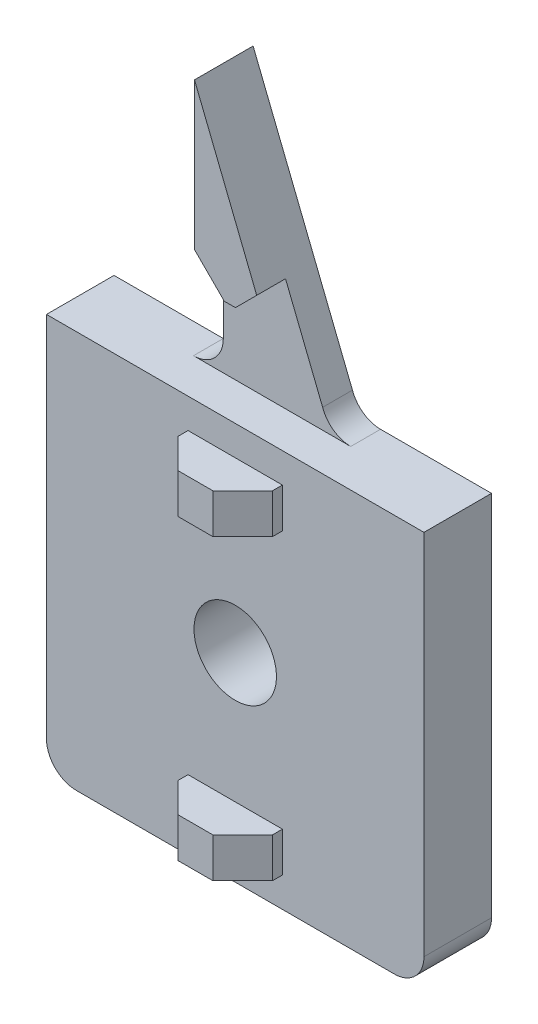
ISO-10303-21;
HEADER;
FILE_DESCRIPTION(('STEP AP214'),'2;1');
FILE_NAME('part.step','',(''),(''),'','','');
FILE_SCHEMA(('AUTOMOTIVE_DESIGN { 1 0 10303 214 1 1 1 1 }'));
ENDSEC;
DATA;
#1=APPLICATION_CONTEXT('core data for automotive mechanical design processes');
#2=APPLICATION_PROTOCOL_DEFINITION('international standard','automotive_design',2000,#1);
#3=PRODUCT_CONTEXT('',#1,'mechanical');
#4=PRODUCT('Part','Part','',(#3));
#5=PRODUCT_RELATED_PRODUCT_CATEGORY('part','',(#4));
#6=PRODUCT_DEFINITION_FORMATION('','',#4);
#7=PRODUCT_DEFINITION_CONTEXT('part definition',#1,'design');
#8=PRODUCT_DEFINITION('design','',#6,#7);
#9=PRODUCT_DEFINITION_SHAPE('','',#8);
#10=(LENGTH_UNIT() NAMED_UNIT(*) SI_UNIT(.MILLI.,.METRE.));
#11=(NAMED_UNIT(*) PLANE_ANGLE_UNIT() SI_UNIT($,.RADIAN.));
#12=(NAMED_UNIT(*) SI_UNIT($,.STERADIAN.) SOLID_ANGLE_UNIT());
#13=UNCERTAINTY_MEASURE_WITH_UNIT(LENGTH_MEASURE(1.E-05),#10,'distance_accuracy_value','');
#14=(GEOMETRIC_REPRESENTATION_CONTEXT(3) GLOBAL_UNCERTAINTY_ASSIGNED_CONTEXT((#13)) GLOBAL_UNIT_ASSIGNED_CONTEXT((#10,
#11,#12)) REPRESENTATION_CONTEXT('',''));
#15=CARTESIAN_POINT('',(0.,0.,0.));
#16=DIRECTION('',(0.,0.,1.));
#17=DIRECTION('',(1.,0.,0.));
#18=AXIS2_PLACEMENT_3D('',#15,#16,#17);
#19=CARTESIAN_POINT('',(0.,0.,0.));
#20=DIRECTION('',(0.,0.,1.));
#21=DIRECTION('',(1.,0.,0.));
#22=AXIS2_PLACEMENT_3D('',#19,#20,#21);
#23=PLANE('',#22);
#24=DIRECTION('',(-0.371390676354104,0.928476690885259,0.));
#25=VECTOR('',#24,1.);
#26=CARTESIAN_POINT('',(11.8965517241379,4.75862068965518,0.));
#27=LINE('',#26,#25);
#28=CARTESIAN_POINT('',(5.,22.,0.));
#29=VERTEX_POINT('',#28);
#30=CARTESIAN_POINT('',(1.26285714285709,31.3428571428573,0.));
#31=VERTEX_POINT('',#30);
#32=EDGE_CURVE('E303',#29,#31,#27,.T.);
#33=ORIENTED_EDGE('',*,*,#32,.T.);
#34=DIRECTION('',(-0.70710678118655,-0.707106781186545,0.));
#35=VECTOR('',#34,1.);
#36=CARTESIAN_POINT('',(1.2628571428571,31.3428571428573,0.));
#37=LINE('',#36,#35);
#38=CARTESIAN_POINT('',(-0.88000000000007,29.2000000000001,0.));
#39=VERTEX_POINT('',#38);
#40=EDGE_CURVE('E11',#31,#39,#37,.T.);
#41=ORIENTED_EDGE('',*,*,#40,.T.);
#42=DIRECTION('',(1.,0.,0.));
#43=VECTOR('',#42,1.);
#44=CARTESIAN_POINT('',(-5.,29.2000000000001,0.));
#45=LINE('',#44,#43);
#46=CARTESIAN_POINT('',(-2.,29.2000000000001,0.));
#47=VERTEX_POINT('',#46);
#48=EDGE_CURVE('E246',#47,#39,#45,.T.);
#49=ORIENTED_EDGE('',*,*,#48,.F.);
#50=DIRECTION('',(-0.707106781186546,0.707106781186549,0.));
#51=VECTOR('',#50,1.);
#52=CARTESIAN_POINT('',(-2.,29.2000000000001,0.));
#53=LINE('',#52,#51);
#54=CARTESIAN_POINT('',(-5.,32.2000000000001,0.));
#55=VERTEX_POINT('',#54);
#56=EDGE_CURVE('E47',#47,#55,#53,.T.);
#57=ORIENTED_EDGE('',*,*,#56,.T.);
#58=DIRECTION('',(0.,-1.,0.));
#59=VECTOR('',#58,1.);
#60=CARTESIAN_POINT('',(-5.,0.,0.));
#61=LINE('',#60,#59);
#62=CARTESIAN_POINT('',(-5.,23.,0.));
#63=VERTEX_POINT('',#62);
#64=EDGE_CURVE('E304',#55,#63,#61,.T.);
#65=ORIENTED_EDGE('',*,*,#64,.T.);
#66=CARTESIAN_POINT('',(-8.,23.,0.));
#67=DIRECTION('',(0.,0.,1.));
#68=DIRECTION('',(1.,0.,0.));
#69=AXIS2_PLACEMENT_3D('',#66,#67,#68);
#70=CIRCLE('',#69,3.);
#71=CARTESIAN_POINT('',(-8.,20.,0.));
#72=VERTEX_POINT('',#71);
#73=EDGE_CURVE('E374',#63,#72,#70,.F.);
#74=ORIENTED_EDGE('',*,*,#73,.T.);
#75=DIRECTION('',(-1.,0.,0.));
#76=VECTOR('',#75,1.);
#77=CARTESIAN_POINT('',(0.,20.,0.));
#78=LINE('',#77,#76);
#79=CARTESIAN_POINT('',(7.8284271247462,20.,0.));
#80=VERTEX_POINT('',#79);
#81=EDGE_CURVE('E308',#80,#72,#78,.T.);
#82=ORIENTED_EDGE('',*,*,#81,.F.);
#83=CARTESIAN_POINT('',(7.8284271247462,23.,0.));
#84=DIRECTION('',(0.,0.,1.));
#85=DIRECTION('',(1.,0.,0.));
#86=AXIS2_PLACEMENT_3D('',#83,#84,#85);
#87=CIRCLE('',#86,3.);
#88=EDGE_CURVE('E379',#80,#29,#87,.F.);
#89=ORIENTED_EDGE('',*,*,#88,.T.);
#90=EDGE_LOOP('',(#33,#41,#49,#57,#65,#74,#82,#89));
#91=FACE_BOUND('',#90,.T.);
#92=ADVANCED_FACE('F39',(#91),#23,.T.);
#93=CARTESIAN_POINT('',(0.,0.,3.8));
#94=DIRECTION('',(0.,0.,-1.));
#95=DIRECTION('',(-1.,0.,0.));
#96=AXIS2_PLACEMENT_3D('',#93,#94,#95);
#97=PLANE('',#96);
#98=DIRECTION('',(0.,1.,0.));
#99=VECTOR('',#98,1.);
#100=CARTESIAN_POINT('',(4.75,13.,3.8));
#101=LINE('',#100,#99);
#102=CARTESIAN_POINT('',(4.75,13.,3.8));
#103=VERTEX_POINT('',#102);
#104=CARTESIAN_POINT('',(4.75,17.,3.8));
#105=VERTEX_POINT('',#104);
#106=EDGE_CURVE('E277',#103,#105,#101,.T.);
#107=ORIENTED_EDGE('',*,*,#106,.F.);
#108=DIRECTION('',(1.,0.,0.));
#109=VECTOR('',#108,1.);
#110=CARTESIAN_POINT('',(-4.75,13.,3.8));
#111=LINE('',#110,#109);
#112=CARTESIAN_POINT('',(-4.75,13.,3.8));
#113=VERTEX_POINT('',#112);
#114=EDGE_CURVE('E282',#113,#103,#111,.T.);
#115=ORIENTED_EDGE('',*,*,#114,.F.);
#116=DIRECTION('',(0.,-1.,0.));
#117=VECTOR('',#116,1.);
#118=CARTESIAN_POINT('',(-4.75,13.,3.8));
#119=LINE('',#118,#117);
#120=CARTESIAN_POINT('',(-4.75,17.,3.8));
#121=VERTEX_POINT('',#120);
#122=EDGE_CURVE('E291',#121,#113,#119,.T.);
#123=ORIENTED_EDGE('',*,*,#122,.F.);
#124=DIRECTION('',(-1.,0.,0.));
#125=VECTOR('',#124,1.);
#126=CARTESIAN_POINT('',(-4.75,17.,3.8));
#127=LINE('',#126,#125);
#128=EDGE_CURVE('E288',#105,#121,#127,.T.);
#129=ORIENTED_EDGE('',*,*,#128,.F.);
#130=EDGE_LOOP('',(#107,#115,#123,#129));
#131=FACE_BOUND('',#130,.T.);
#132=DIRECTION('',(1.,0.,0.));
#133=VECTOR('',#132,1.);
#134=CARTESIAN_POINT('',(-19.,-20.,3.8));
#135=LINE('',#134,#133);
#136=CARTESIAN_POINT('',(-16.,-20.,3.8));
#137=VERTEX_POINT('',#136);
#138=CARTESIAN_POINT('',(16.,-20.,3.8));
#139=VERTEX_POINT('',#138);
#140=EDGE_CURVE('E339',#137,#139,#135,.T.);
#141=ORIENTED_EDGE('',*,*,#140,.T.);
#142=CARTESIAN_POINT('',(16.,-17.,3.8));
#143=DIRECTION('',(0.,0.,-1.));
#144=DIRECTION('',(-1.,0.,0.));
#145=AXIS2_PLACEMENT_3D('',#142,#143,#144);
#146=CIRCLE('',#145,3.);
#147=CARTESIAN_POINT('',(19.,-17.,3.8));
#148=VERTEX_POINT('',#147);
#149=EDGE_CURVE('E370',#139,#148,#146,.F.);
#150=ORIENTED_EDGE('',*,*,#149,.T.);
#151=DIRECTION('',(0.,1.,0.));
#152=VECTOR('',#151,1.);
#153=CARTESIAN_POINT('',(19.,-20.,3.8));
#154=LINE('',#153,#152);
#155=CARTESIAN_POINT('',(19.,20.,3.8));
#156=VERTEX_POINT('',#155);
#157=EDGE_CURVE('E332',#148,#156,#154,.T.);
#158=ORIENTED_EDGE('',*,*,#157,.T.);
#159=DIRECTION('',(-1.,0.,0.));
#160=VECTOR('',#159,1.);
#161=CARTESIAN_POINT('',(-19.,20.,3.8));
#162=LINE('',#161,#160);
#163=CARTESIAN_POINT('',(-19.,20.,3.8));
#164=VERTEX_POINT('',#163);
#165=EDGE_CURVE('E334',#156,#164,#162,.T.);
#166=ORIENTED_EDGE('',*,*,#165,.T.);
#167=DIRECTION('',(0.,-1.,0.));
#168=VECTOR('',#167,1.);
#169=CARTESIAN_POINT('',(-19.,-20.,3.8));
#170=LINE('',#169,#168);
#171=CARTESIAN_POINT('',(-19.,-17.,3.8));
#172=VERTEX_POINT('',#171);
#173=EDGE_CURVE('E336',#164,#172,#170,.T.);
#174=ORIENTED_EDGE('',*,*,#173,.T.);
#175=CARTESIAN_POINT('',(-16.,-17.,3.8));
#176=DIRECTION('',(0.,0.,-1.));
#177=DIRECTION('',(-1.,0.,0.));
#178=AXIS2_PLACEMENT_3D('',#175,#176,#177);
#179=CIRCLE('',#178,3.);
#180=EDGE_CURVE('E368',#172,#137,#179,.F.);
#181=ORIENTED_EDGE('',*,*,#180,.T.);
#182=EDGE_LOOP('',(#141,#150,#158,#166,#174,#181));
#183=FACE_BOUND('',#182,.T.);
#184=CARTESIAN_POINT('',(0.,0.,3.8));
#185=DIRECTION('',(0.,0.,1.));
#186=DIRECTION('',(1.,0.,0.));
#187=AXIS2_PLACEMENT_3D('',#184,#185,#186);
#188=CIRCLE('',#187,4.15);
#189=CARTESIAN_POINT('',(-4.15,0.,3.8));
#190=VERTEX_POINT('',#189);
#191=EDGE_CURVE('E329',#190,#190,#188,.T.);
#192=ORIENTED_EDGE('',*,*,#191,.F.);
#193=EDGE_LOOP('',(#192));
#194=FACE_BOUND('',#193,.T.);
#195=DIRECTION('',(0.,1.,0.));
#196=VECTOR('',#195,1.);
#197=CARTESIAN_POINT('',(4.75,-17.,3.8));
#198=LINE('',#197,#196);
#199=CARTESIAN_POINT('',(4.75,-17.,3.8));
#200=VERTEX_POINT('',#199);
#201=CARTESIAN_POINT('',(4.75,-13.,3.8));
#202=VERTEX_POINT('',#201);
#203=EDGE_CURVE('E230',#200,#202,#198,.T.);
#204=ORIENTED_EDGE('',*,*,#203,.F.);
#205=DIRECTION('',(1.,0.,0.));
#206=VECTOR('',#205,1.);
#207=CARTESIAN_POINT('',(-4.75,-17.,3.8));
#208=LINE('',#207,#206);
#209=CARTESIAN_POINT('',(-4.75,-17.,3.8));
#210=VERTEX_POINT('',#209);
#211=EDGE_CURVE('E256',#210,#200,#208,.T.);
#212=ORIENTED_EDGE('',*,*,#211,.F.);
#213=DIRECTION('',(0.,-1.,0.));
#214=VECTOR('',#213,1.);
#215=CARTESIAN_POINT('',(-4.75,-17.,3.8));
#216=LINE('',#215,#214);
#217=CARTESIAN_POINT('',(-4.75,-13.,3.8));
#218=VERTEX_POINT('',#217);
#219=EDGE_CURVE('E265',#218,#210,#216,.T.);
#220=ORIENTED_EDGE('',*,*,#219,.F.);
#221=DIRECTION('',(-1.,0.,0.));
#222=VECTOR('',#221,1.);
#223=CARTESIAN_POINT('',(-4.75,-13.,3.8));
#224=LINE('',#223,#222);
#225=EDGE_CURVE('E262',#202,#218,#224,.T.);
#226=ORIENTED_EDGE('',*,*,#225,.F.);
#227=EDGE_LOOP('',(#204,#212,#220,#226));
#228=FACE_BOUND('',#227,.T.);
#229=ADVANCED_FACE('F470',(#131,#183,#194,#228),#97,.F.);
#230=CARTESIAN_POINT('',(19.,-20.,3.8));
#231=DIRECTION('',(-1.,0.,0.));
#232=DIRECTION('',(0.,0.,1.));
#233=AXIS2_PLACEMENT_3D('',#230,#231,#232);
#234=PLANE('',#233);
#235=ORIENTED_EDGE('',*,*,#157,.F.);
#236=DIRECTION('',(0.,0.,-1.));
#237=VECTOR('',#236,1.);
#238=CARTESIAN_POINT('',(19.,-17.,3.8));
#239=LINE('',#238,#237);
#240=CARTESIAN_POINT('',(19.,-17.,-3.));
#241=VERTEX_POINT('',#240);
#242=EDGE_CURVE('E356',#148,#241,#239,.T.);
#243=ORIENTED_EDGE('',*,*,#242,.T.);
#244=DIRECTION('',(0.,1.,0.));
#245=VECTOR('',#244,1.);
#246=CARTESIAN_POINT('',(19.,-20.,-3.));
#247=LINE('',#246,#245);
#248=CARTESIAN_POINT('',(19.,20.,-3.));
#249=VERTEX_POINT('',#248);
#250=EDGE_CURVE('E317',#241,#249,#247,.T.);
#251=ORIENTED_EDGE('',*,*,#250,.T.);
#252=DIRECTION('',(0.,0.,-1.));
#253=VECTOR('',#252,1.);
#254=CARTESIAN_POINT('',(19.,20.,3.8));
#255=LINE('',#254,#253);
#256=EDGE_CURVE('E345',#156,#249,#255,.T.);
#257=ORIENTED_EDGE('',*,*,#256,.F.);
#258=EDGE_LOOP('',(#235,#243,#251,#257));
#259=FACE_BOUND('',#258,.T.);
#260=ADVANCED_FACE('F458',(#259),#234,.F.);
#261=CARTESIAN_POINT('',(-19.,20.,3.8));
#262=DIRECTION('',(0.,-1.,0.));
#263=DIRECTION('',(0.,0.,-1.));
#264=AXIS2_PLACEMENT_3D('',#261,#262,#263);
#265=PLANE('',#264);
#266=ORIENTED_EDGE('',*,*,#81,.T.);
#267=DIRECTION('',(0.,0.,1.));
#268=VECTOR('',#267,1.);
#269=CARTESIAN_POINT('',(-8.,20.,3.8));
#270=LINE('',#269,#268);
#271=CARTESIAN_POINT('',(-8.,20.,-3.));
#272=VERTEX_POINT('',#271);
#273=EDGE_CURVE('E354',#72,#272,#270,.F.);
#274=ORIENTED_EDGE('',*,*,#273,.T.);
#275=DIRECTION('',(-1.,0.,0.));
#276=VECTOR('',#275,1.);
#277=CARTESIAN_POINT('',(-19.,20.,-3.));
#278=LINE('',#277,#276);
#279=CARTESIAN_POINT('',(-19.,20.,-3.));
#280=VERTEX_POINT('',#279);
#281=EDGE_CURVE('E319',#272,#280,#278,.T.);
#282=ORIENTED_EDGE('',*,*,#281,.T.);
#283=DIRECTION('',(0.,0.,-1.));
#284=VECTOR('',#283,1.);
#285=CARTESIAN_POINT('',(-19.,20.,3.8));
#286=LINE('',#285,#284);
#287=EDGE_CURVE('E342',#164,#280,#286,.T.);
#288=ORIENTED_EDGE('',*,*,#287,.F.);
#289=ORIENTED_EDGE('',*,*,#165,.F.);
#290=ORIENTED_EDGE('',*,*,#256,.T.);
#291=CARTESIAN_POINT('',(7.8284271247462,20.,-3.));
#292=VERTEX_POINT('',#291);
#293=EDGE_CURVE('E320',#249,#292,#278,.T.);
#294=ORIENTED_EDGE('',*,*,#293,.T.);
#295=DIRECTION('',(0.,0.,1.));
#296=VECTOR('',#295,1.);
#297=CARTESIAN_POINT('',(7.8284271247462,20.,3.8));
#298=LINE('',#297,#296);
#299=EDGE_CURVE('E351',#292,#80,#298,.T.);
#300=ORIENTED_EDGE('',*,*,#299,.T.);
#301=EDGE_LOOP('',(#266,#274,#282,#288,#289,#290,#294,#300));
#302=FACE_BOUND('',#301,.T.);
#303=ADVANCED_FACE('F452',(#302),#265,.F.);
#304=CARTESIAN_POINT('',(-19.,-20.,3.8));
#305=DIRECTION('',(1.,0.,0.));
#306=DIRECTION('',(0.,0.,-1.));
#307=AXIS2_PLACEMENT_3D('',#304,#305,#306);
#308=PLANE('',#307);
#309=DIRECTION('',(0.,-1.,0.));
#310=VECTOR('',#309,1.);
#311=CARTESIAN_POINT('',(-19.,-20.,-3.));
#312=LINE('',#311,#310);
#313=CARTESIAN_POINT('',(-19.,-17.,-3.));
#314=VERTEX_POINT('',#313);
#315=EDGE_CURVE('E323',#280,#314,#312,.T.);
#316=ORIENTED_EDGE('',*,*,#315,.T.);
#317=DIRECTION('',(0.,0.,-1.));
#318=VECTOR('',#317,1.);
#319=CARTESIAN_POINT('',(-19.,-17.,3.8));
#320=LINE('',#319,#318);
#321=EDGE_CURVE('E372',#314,#172,#320,.F.);
#322=ORIENTED_EDGE('',*,*,#321,.T.);
#323=ORIENTED_EDGE('',*,*,#173,.F.);
#324=ORIENTED_EDGE('',*,*,#287,.T.);
#325=EDGE_LOOP('',(#316,#322,#323,#324));
#326=FACE_BOUND('',#325,.T.);
#327=ADVANCED_FACE('F479',(#326),#308,.F.);
#328=CARTESIAN_POINT('',(-19.,-20.,3.8));
#329=DIRECTION('',(0.,1.,0.));
#330=DIRECTION('',(0.,0.,1.));
#331=AXIS2_PLACEMENT_3D('',#328,#329,#330);
#332=PLANE('',#331);
#333=DIRECTION('',(1.,0.,0.));
#334=VECTOR('',#333,1.);
#335=CARTESIAN_POINT('',(-19.,-20.,-3.));
#336=LINE('',#335,#334);
#337=CARTESIAN_POINT('',(-16.,-20.,-3.));
#338=VERTEX_POINT('',#337);
#339=CARTESIAN_POINT('',(16.,-20.,-3.));
#340=VERTEX_POINT('',#339);
#341=EDGE_CURVE('E326',#338,#340,#336,.T.);
#342=ORIENTED_EDGE('',*,*,#341,.T.);
#343=DIRECTION('',(0.,0.,-1.));
#344=VECTOR('',#343,1.);
#345=CARTESIAN_POINT('',(16.,-20.,3.8));
#346=LINE('',#345,#344);
#347=EDGE_CURVE('E366',#340,#139,#346,.F.);
#348=ORIENTED_EDGE('',*,*,#347,.T.);
#349=ORIENTED_EDGE('',*,*,#140,.F.);
#350=DIRECTION('',(0.,0.,-1.));
#351=VECTOR('',#350,1.);
#352=CARTESIAN_POINT('',(-16.,-20.,3.8));
#353=LINE('',#352,#351);
#354=EDGE_CURVE('E363',#137,#338,#353,.T.);
#355=ORIENTED_EDGE('',*,*,#354,.T.);
#356=EDGE_LOOP('',(#342,#348,#349,#355));
#357=FACE_BOUND('',#356,.T.);
#358=ADVANCED_FACE('F464',(#357),#332,.F.);
#359=CARTESIAN_POINT('',(0.,0.,3.8));
#360=DIRECTION('',(0.,0.,-1.));
#361=DIRECTION('',(-1.,0.,0.));
#362=AXIS2_PLACEMENT_3D('',#359,#360,#361);
#363=CYLINDRICAL_SURFACE('',#362,4.15);
#364=CARTESIAN_POINT('',(0.,0.,-3.));
#365=DIRECTION('',(0.,0.,1.));
#366=DIRECTION('',(1.,0.,0.));
#367=AXIS2_PLACEMENT_3D('',#364,#365,#366);
#368=CIRCLE('',#367,4.15);
#369=CARTESIAN_POINT('',(-4.15,0.,-3.));
#370=VERTEX_POINT('',#369);
#371=EDGE_CURVE('E310',#370,#370,#368,.T.);
#372=CARTESIAN_POINT('',(-4.15,0.,3.8));
#373=CARTESIAN_POINT('',(-4.15,0.,3.72916666666667));
#374=CARTESIAN_POINT('',(-4.15,0.,3.65833333333333));
#375=CARTESIAN_POINT('',(-4.15,0.,3.51666666666667));
#376=CARTESIAN_POINT('',(-4.15,0.,3.44583333333333));
#377=CARTESIAN_POINT('',(-4.15,0.,3.30416666666667));
#378=CARTESIAN_POINT('',(-4.15,0.,3.23333333333333));
#379=CARTESIAN_POINT('',(-4.15,0.,3.09166666666667));
#380=CARTESIAN_POINT('',(-4.15,0.,3.02083333333333));
#381=CARTESIAN_POINT('',(-4.15,0.,2.87916666666667));
#382=CARTESIAN_POINT('',(-4.15,0.,2.80833333333333));
#383=CARTESIAN_POINT('',(-4.15,0.,2.66666666666667));
#384=CARTESIAN_POINT('',(-4.15,0.,2.59583333333333));
#385=CARTESIAN_POINT('',(-4.15,0.,2.45416666666667));
#386=CARTESIAN_POINT('',(-4.15,0.,2.38333333333333));
#387=CARTESIAN_POINT('',(-4.15,0.,2.24166666666667));
#388=CARTESIAN_POINT('',(-4.15,0.,2.17083333333333));
#389=CARTESIAN_POINT('',(-4.15,0.,2.02916666666667));
#390=CARTESIAN_POINT('',(-4.15,0.,1.95833333333333));
#391=CARTESIAN_POINT('',(-4.15,0.,1.81666666666667));
#392=CARTESIAN_POINT('',(-4.15,0.,1.74583333333333));
#393=CARTESIAN_POINT('',(-4.15,0.,1.60416666666667));
#394=CARTESIAN_POINT('',(-4.15,0.,1.53333333333333));
#395=CARTESIAN_POINT('',(-4.15,0.,1.39166666666667));
#396=CARTESIAN_POINT('',(-4.15,0.,1.32083333333333));
#397=CARTESIAN_POINT('',(-4.15,0.,1.17916666666667));
#398=CARTESIAN_POINT('',(-4.15,0.,1.10833333333333));
#399=CARTESIAN_POINT('',(-4.15,0.,0.966666666666667));
#400=CARTESIAN_POINT('',(-4.15,0.,0.895833333333334));
#401=CARTESIAN_POINT('',(-4.15,0.,0.754166666666667));
#402=CARTESIAN_POINT('',(-4.15,0.,0.683333333333334));
#403=CARTESIAN_POINT('',(-4.15,0.,0.541666666666667));
#404=CARTESIAN_POINT('',(-4.15,0.,0.470833333333334));
#405=CARTESIAN_POINT('',(-4.15,0.,0.329166666666667));
#406=CARTESIAN_POINT('',(-4.15,0.,0.258333333333334));
#407=CARTESIAN_POINT('',(-4.15,0.,0.116666666666667));
#408=CARTESIAN_POINT('',(-4.15,0.,0.0458333333333335));
#409=CARTESIAN_POINT('',(-4.15,0.,-0.095833333333333));
#410=CARTESIAN_POINT('',(-4.15,0.,-0.166666666666666));
#411=CARTESIAN_POINT('',(-4.15,0.,-0.308333333333333));
#412=CARTESIAN_POINT('',(-4.15,0.,-0.379166666666666));
#413=CARTESIAN_POINT('',(-4.15,0.,-0.520833333333333));
#414=CARTESIAN_POINT('',(-4.15,0.,-0.591666666666666));
#415=CARTESIAN_POINT('',(-4.15,0.,-0.733333333333333));
#416=CARTESIAN_POINT('',(-4.15,0.,-0.804166666666666));
#417=CARTESIAN_POINT('',(-4.15,0.,-0.945833333333333));
#418=CARTESIAN_POINT('',(-4.15,0.,-1.01666666666667));
#419=CARTESIAN_POINT('',(-4.15,0.,-1.15833333333333));
#420=CARTESIAN_POINT('',(-4.15,0.,-1.22916666666667));
#421=CARTESIAN_POINT('',(-4.15,0.,-1.37083333333333));
#422=CARTESIAN_POINT('',(-4.15,0.,-1.44166666666667));
#423=CARTESIAN_POINT('',(-4.15,0.,-1.58333333333333));
#424=CARTESIAN_POINT('',(-4.15,0.,-1.65416666666667));
#425=CARTESIAN_POINT('',(-4.15,0.,-1.79583333333333));
#426=CARTESIAN_POINT('',(-4.15,0.,-1.86666666666667));
#427=CARTESIAN_POINT('',(-4.15,0.,-2.00833333333333));
#428=CARTESIAN_POINT('',(-4.15,0.,-2.07916666666667));
#429=CARTESIAN_POINT('',(-4.15,0.,-2.22083333333333));
#430=CARTESIAN_POINT('',(-4.15,0.,-2.29166666666667));
#431=CARTESIAN_POINT('',(-4.15,0.,-2.43333333333333));
#432=CARTESIAN_POINT('',(-4.15,0.,-2.50416666666667));
#433=CARTESIAN_POINT('',(-4.15,0.,-2.64583333333333));
#434=CARTESIAN_POINT('',(-4.15,0.,-2.71666666666667));
#435=CARTESIAN_POINT('',(-4.15,0.,-2.85833333333333));
#436=CARTESIAN_POINT('',(-4.15,0.,-2.92916666666667));
#437=CARTESIAN_POINT('',(-4.15,0.,-3.));
#438=B_SPLINE_CURVE_WITH_KNOTS('',3,(#372,#373,#374,#375,#376,#377,#378,#379,#380,#381,#382,
#383,#384,#385,#386,#387,#388,#389,#390,#391,#392,#393,#394,#395,#396,#397,#398,#399,#400,#401,
#402,#403,#404,#405,#406,#407,#408,#409,#410,#411,#412,#413,#414,#415,#416,#417,#418,#419,#420,
#421,#422,#423,#424,#425,#426,#427,#428,#429,#430,#431,#432,#433,#434,#435,#436,#437),
.UNSPECIFIED.,.F.,.F.,(4,2,2,2,2,2,2,2,2,2,2,2,2,2,2,2,2,2,2,2,2,2,2,2,2,2,2,2,2,2,2,2,4),(0.,
0.2125,0.425,0.6375,0.85,1.0625,1.275,1.4875,1.7,1.9125,2.125,2.3375,2.55,2.7625,2.975,3.1875,
3.4,3.6125,3.825,4.0375,4.25,4.4625,4.675,4.8875,5.1,5.3125,5.525,5.7375,5.95,6.1625,6.375,
6.5875,6.8),.UNSPECIFIED.);
#439=EDGE_CURVE('BSEAM510',#190,#370,#438,.T.);
#440=ORIENTED_EDGE('',*,*,#191,.T.);
#441=ORIENTED_EDGE('',*,*,#371,.F.);
#442=ORIENTED_EDGE('',*,*,#439,.T.);
#443=ORIENTED_EDGE('',*,*,#439,.F.);
#444=EDGE_LOOP('',(#440,#442,#441,#443));
#445=FACE_BOUND('',#444,.T.);
#446=ADVANCED_FACE('F510',(#445),#363,.F.);
#447=CARTESIAN_POINT('',(0.,0.,-3.));
#448=DIRECTION('',(0.,0.,-1.));
#449=DIRECTION('',(-1.,0.,0.));
#450=AXIS2_PLACEMENT_3D('',#447,#448,#449);
#451=PLANE('',#450);
#452=ORIENTED_EDGE('',*,*,#371,.T.);
#453=EDGE_LOOP('',(#452));
#454=FACE_BOUND('',#453,.T.);
#455=ORIENTED_EDGE('',*,*,#250,.F.);
#456=CARTESIAN_POINT('',(16.,-17.,-3.));
#457=DIRECTION('',(0.,0.,-1.));
#458=DIRECTION('',(-1.,0.,0.));
#459=AXIS2_PLACEMENT_3D('',#456,#457,#458);
#460=CIRCLE('',#459,3.);
#461=EDGE_CURVE('E361',#241,#340,#460,.T.);
#462=ORIENTED_EDGE('',*,*,#461,.T.);
#463=ORIENTED_EDGE('',*,*,#341,.F.);
#464=CARTESIAN_POINT('',(-16.,-17.,-3.));
#465=DIRECTION('',(0.,0.,-1.));
#466=DIRECTION('',(-1.,0.,0.));
#467=AXIS2_PLACEMENT_3D('',#464,#465,#466);
#468=CIRCLE('',#467,3.);
#469=EDGE_CURVE('E359',#338,#314,#468,.T.);
#470=ORIENTED_EDGE('',*,*,#469,.T.);
#471=ORIENTED_EDGE('',*,*,#315,.F.);
#472=ORIENTED_EDGE('',*,*,#281,.F.);
#473=CARTESIAN_POINT('',(-8.,23.,-3.));
#474=DIRECTION('',(0.,0.,-1.));
#475=DIRECTION('',(-1.,0.,0.));
#476=AXIS2_PLACEMENT_3D('',#473,#474,#475);
#477=CIRCLE('',#476,3.);
#478=CARTESIAN_POINT('',(-5.,23.,-3.));
#479=VERTEX_POINT('',#478);
#480=EDGE_CURVE('E377',#272,#479,#477,.F.);
#481=ORIENTED_EDGE('',*,*,#480,.T.);
#482=DIRECTION('',(0.,-1.,0.));
#483=VECTOR('',#482,1.);
#484=CARTESIAN_POINT('',(-5.,0.,-3.));
#485=LINE('',#484,#483);
#486=CARTESIAN_POINT('',(-5.,47.,-3.));
#487=VERTEX_POINT('',#486);
#488=EDGE_CURVE('E241',#487,#479,#485,.T.);
#489=ORIENTED_EDGE('',*,*,#488,.F.);
#490=DIRECTION('',(-0.371390676354104,0.928476690885259,0.));
#491=VECTOR('',#490,1.);
#492=CARTESIAN_POINT('',(11.8965517241379,4.75862068965518,-3.));
#493=LINE('',#492,#491);
#494=CARTESIAN_POINT('',(5.,22.,-3.));
#495=VERTEX_POINT('',#494);
#496=EDGE_CURVE('E238',#495,#487,#493,.T.);
#497=ORIENTED_EDGE('',*,*,#496,.F.);
#498=CARTESIAN_POINT('',(7.8284271247462,23.,-3.));
#499=DIRECTION('',(0.,0.,-1.));
#500=DIRECTION('',(-1.,0.,0.));
#501=AXIS2_PLACEMENT_3D('',#498,#499,#500);
#502=CIRCLE('',#501,3.);
#503=EDGE_CURVE('E381',#495,#292,#502,.F.);
#504=ORIENTED_EDGE('',*,*,#503,.T.);
#505=ORIENTED_EDGE('',*,*,#293,.F.);
#506=EDGE_LOOP('',(#455,#462,#463,#470,#471,#472,#481,#489,#497,#504,#505));
#507=FACE_BOUND('',#506,.T.);
#508=ADVANCED_FACE('F450',(#454,#507),#451,.T.);
#509=CARTESIAN_POINT('',(11.8965517241379,4.75862068965518,-31.7923600977759));
#510=DIRECTION('',(0.928476690885259,0.371390676354104,0.));
#511=DIRECTION('',(-0.371390676354104,0.928476690885259,0.));
#512=AXIS2_PLACEMENT_3D('',#509,#510,#511);
#513=PLANE('',#512);
#514=DIRECTION('',(-0.371390676354104,0.928476690885259,0.));
#515=VECTOR('',#514,1.);
#516=CARTESIAN_POINT('',(2.11999999999995,29.2000000000001,2.9));
#517=LINE('',#516,#515);
#518=CARTESIAN_POINT('',(1.26285714285709,31.3428571428573,2.9));
#519=VERTEX_POINT('',#518);
#520=CARTESIAN_POINT('',(-5.,47.,2.9));
#521=VERTEX_POINT('',#520);
#522=EDGE_CURVE('E218',#519,#521,#517,.T.);
#523=ORIENTED_EDGE('',*,*,#522,.F.);
#524=DIRECTION('',(0.,0.,-1.));
#525=VECTOR('',#524,1.);
#526=CARTESIAN_POINT('',(1.26285714285709,31.3428571428573,0.));
#527=LINE('',#526,#525);
#528=EDGE_CURVE('E392',#519,#31,#527,.T.);
#529=ORIENTED_EDGE('',*,*,#528,.T.);
#530=ORIENTED_EDGE('',*,*,#32,.F.);
#531=DIRECTION('',(0.,0.,1.));
#532=VECTOR('',#531,1.);
#533=CARTESIAN_POINT('',(5.,22.,-31.7923600977759));
#534=LINE('',#533,#532);
#535=EDGE_CURVE('E306',#495,#29,#534,.T.);
#536=ORIENTED_EDGE('',*,*,#535,.F.);
#537=ORIENTED_EDGE('',*,*,#496,.T.);
#538=DIRECTION('',(0.,0.,1.));
#539=VECTOR('',#538,1.);
#540=CARTESIAN_POINT('',(-5.,47.,-31.7923600977759));
#541=LINE('',#540,#539);
#542=EDGE_CURVE('E235',#487,#521,#541,.T.);
#543=ORIENTED_EDGE('',*,*,#542,.T.);
#544=EDGE_LOOP('',(#523,#529,#530,#536,#537,#543));
#545=FACE_BOUND('',#544,.T.);
#546=ADVANCED_FACE('F236',(#545),#513,.T.);
#547=CARTESIAN_POINT('',(-5.,0.,-31.7923600977759));
#548=DIRECTION('',(-1.,0.,0.));
#549=DIRECTION('',(0.,-1.,0.));
#550=AXIS2_PLACEMENT_3D('',#547,#548,#549);
#551=PLANE('',#550);
#552=ORIENTED_EDGE('',*,*,#64,.F.);
#553=DIRECTION('',(0.,0.,1.));
#554=VECTOR('',#553,1.);
#555=CARTESIAN_POINT('',(-5.,32.2000000000001,2.9));
#556=LINE('',#555,#554);
#557=CARTESIAN_POINT('',(-5.,32.2000000000001,2.9));
#558=VERTEX_POINT('',#557);
#559=EDGE_CURVE('E245',#55,#558,#556,.T.);
#560=ORIENTED_EDGE('',*,*,#559,.T.);
#561=DIRECTION('',(0.,-1.,0.));
#562=VECTOR('',#561,1.);
#563=CARTESIAN_POINT('',(-5.,47.,2.9));
#564=LINE('',#563,#562);
#565=EDGE_CURVE('E222',#521,#558,#564,.T.);
#566=ORIENTED_EDGE('',*,*,#565,.F.);
#567=ORIENTED_EDGE('',*,*,#542,.F.);
#568=ORIENTED_EDGE('',*,*,#488,.T.);
#569=DIRECTION('',(0.,0.,1.));
#570=VECTOR('',#569,1.);
#571=CARTESIAN_POINT('',(-5.,23.,-31.7923600977759));
#572=LINE('',#571,#570);
#573=EDGE_CURVE('E348',#479,#63,#572,.T.);
#574=ORIENTED_EDGE('',*,*,#573,.T.);
#575=EDGE_LOOP('',(#552,#560,#566,#567,#568,#574));
#576=FACE_BOUND('',#575,.T.);
#577=ADVANCED_FACE('F243',(#576),#551,.T.);
#578=CARTESIAN_POINT('',(-8.,23.,-31.7923600977759));
#579=DIRECTION('',(0.,0.,1.));
#580=DIRECTION('',(1.,0.,0.));
#581=AXIS2_PLACEMENT_3D('',#578,#579,#580);
#582=CYLINDRICAL_SURFACE('',#581,3.);
#583=ORIENTED_EDGE('',*,*,#480,.F.);
#584=ORIENTED_EDGE('',*,*,#273,.F.);
#585=ORIENTED_EDGE('',*,*,#73,.F.);
#586=ORIENTED_EDGE('',*,*,#573,.F.);
#587=EDGE_LOOP('',(#583,#584,#585,#586));
#588=FACE_BOUND('',#587,.T.);
#589=ADVANCED_FACE('F485',(#588),#582,.F.);
#590=CARTESIAN_POINT('',(7.8284271247462,23.,-31.7923600977759));
#591=DIRECTION('',(0.,0.,1.));
#592=DIRECTION('',(1.,0.,0.));
#593=AXIS2_PLACEMENT_3D('',#590,#591,#592);
#594=CYLINDRICAL_SURFACE('',#593,3.);
#595=ORIENTED_EDGE('',*,*,#503,.F.);
#596=ORIENTED_EDGE('',*,*,#535,.T.);
#597=ORIENTED_EDGE('',*,*,#88,.F.);
#598=ORIENTED_EDGE('',*,*,#299,.F.);
#599=EDGE_LOOP('',(#595,#596,#597,#598));
#600=FACE_BOUND('',#599,.T.);
#601=ADVANCED_FACE('F445',(#600),#594,.F.);
#602=CARTESIAN_POINT('',(16.,-17.,3.8));
#603=DIRECTION('',(0.,0.,-1.));
#604=DIRECTION('',(-1.,0.,0.));
#605=AXIS2_PLACEMENT_3D('',#602,#603,#604);
#606=CYLINDRICAL_SURFACE('',#605,3.);
#607=ORIENTED_EDGE('',*,*,#149,.F.);
#608=ORIENTED_EDGE('',*,*,#347,.F.);
#609=ORIENTED_EDGE('',*,*,#461,.F.);
#610=ORIENTED_EDGE('',*,*,#242,.F.);
#611=EDGE_LOOP('',(#607,#608,#609,#610));
#612=FACE_BOUND('',#611,.T.);
#613=ADVANCED_FACE('F468',(#612),#606,.T.);
#614=CARTESIAN_POINT('',(-16.,-17.,3.8));
#615=DIRECTION('',(0.,0.,-1.));
#616=DIRECTION('',(-1.,0.,0.));
#617=AXIS2_PLACEMENT_3D('',#614,#615,#616);
#618=CYLINDRICAL_SURFACE('',#617,3.);
#619=ORIENTED_EDGE('',*,*,#180,.F.);
#620=ORIENTED_EDGE('',*,*,#321,.F.);
#621=ORIENTED_EDGE('',*,*,#469,.F.);
#622=ORIENTED_EDGE('',*,*,#354,.F.);
#623=EDGE_LOOP('',(#619,#620,#621,#622));
#624=FACE_BOUND('',#623,.T.);
#625=ADVANCED_FACE('F474',(#624),#618,.T.);
#626=CARTESIAN_POINT('',(4.75,13.,7.8));
#627=DIRECTION('',(-1.,0.,0.));
#628=DIRECTION('',(0.,0.,1.));
#629=AXIS2_PLACEMENT_3D('',#626,#627,#628);
#630=PLANE('',#629);
#631=DIRECTION('',(0.,0.,-1.));
#632=VECTOR('',#631,1.);
#633=CARTESIAN_POINT('',(4.75,17.,7.8));
#634=LINE('',#633,#632);
#635=CARTESIAN_POINT('',(4.75,17.,4.8));
#636=VERTEX_POINT('',#635);
#637=EDGE_CURVE('E301',#636,#105,#634,.T.);
#638=ORIENTED_EDGE('',*,*,#637,.F.);
#639=DIRECTION('',(0.,-1.,0.));
#640=VECTOR('',#639,1.);
#641=CARTESIAN_POINT('',(4.75,13.,4.8));
#642=LINE('',#641,#640);
#643=CARTESIAN_POINT('',(4.75,13.,4.8));
#644=VERTEX_POINT('',#643);
#645=EDGE_CURVE('E404',#636,#644,#642,.T.);
#646=ORIENTED_EDGE('',*,*,#645,.T.);
#647=DIRECTION('',(0.,0.,-1.));
#648=VECTOR('',#647,1.);
#649=CARTESIAN_POINT('',(4.75,13.,7.8));
#650=LINE('',#649,#648);
#651=EDGE_CURVE('E285',#644,#103,#650,.T.);
#652=ORIENTED_EDGE('',*,*,#651,.T.);
#653=ORIENTED_EDGE('',*,*,#106,.T.);
#654=EDGE_LOOP('',(#638,#646,#652,#653));
#655=FACE_BOUND('',#654,.T.);
#656=ADVANCED_FACE('F505',(#655),#630,.F.);
#657=CARTESIAN_POINT('',(-4.75,17.,7.8));
#658=DIRECTION('',(0.,-1.,0.));
#659=DIRECTION('',(0.,0.,-1.));
#660=AXIS2_PLACEMENT_3D('',#657,#658,#659);
#661=PLANE('',#660);
#662=DIRECTION('',(-1.,0.,0.));
#663=VECTOR('',#662,1.);
#664=CARTESIAN_POINT('',(-4.75,17.,7.8));
#665=LINE('',#664,#663);
#666=CARTESIAN_POINT('',(1.75000000000001,17.,7.8));
#667=VERTEX_POINT('',#666);
#668=CARTESIAN_POINT('',(-1.75000000000001,17.,7.8));
#669=VERTEX_POINT('',#668);
#670=EDGE_CURVE('E278',#667,#669,#665,.T.);
#671=ORIENTED_EDGE('',*,*,#670,.F.);
#672=DIRECTION('',(-0.707106781186546,0.,0.707106781186549));
#673=VECTOR('',#672,1.);
#674=CARTESIAN_POINT('',(1.75000000000001,17.,7.8));
#675=LINE('',#674,#673);
#676=EDGE_CURVE('E402',#667,#636,#675,.F.);
#677=ORIENTED_EDGE('',*,*,#676,.T.);
#678=ORIENTED_EDGE('',*,*,#637,.T.);
#679=ORIENTED_EDGE('',*,*,#128,.T.);
#680=DIRECTION('',(0.,0.,-1.));
#681=VECTOR('',#680,1.);
#682=CARTESIAN_POINT('',(-4.75,17.,7.8));
#683=LINE('',#682,#681);
#684=CARTESIAN_POINT('',(-4.75,17.,4.8));
#685=VERTEX_POINT('',#684);
#686=EDGE_CURVE('E299',#685,#121,#683,.T.);
#687=ORIENTED_EDGE('',*,*,#686,.F.);
#688=DIRECTION('',(-0.707106781186546,0.,-0.707106781186549));
#689=VECTOR('',#688,1.);
#690=CARTESIAN_POINT('',(-1.75000000000001,17.,7.8));
#691=LINE('',#690,#689);
#692=EDGE_CURVE('E400',#685,#669,#691,.F.);
#693=ORIENTED_EDGE('',*,*,#692,.T.);
#694=EDGE_LOOP('',(#671,#677,#678,#679,#687,#693));
#695=FACE_BOUND('',#694,.T.);
#696=ADVANCED_FACE('F586',(#695),#661,.F.);
#697=CARTESIAN_POINT('',(-4.75,13.,7.8));
#698=DIRECTION('',(1.,0.,0.));
#699=DIRECTION('',(0.,0.,-1.));
#700=AXIS2_PLACEMENT_3D('',#697,#698,#699);
#701=PLANE('',#700);
#702=DIRECTION('',(0.,0.,-1.));
#703=VECTOR('',#702,1.);
#704=CARTESIAN_POINT('',(-4.75,13.,7.8));
#705=LINE('',#704,#703);
#706=CARTESIAN_POINT('',(-4.75,13.,4.8));
#707=VERTEX_POINT('',#706);
#708=EDGE_CURVE('E297',#707,#113,#705,.T.);
#709=ORIENTED_EDGE('',*,*,#708,.F.);
#710=DIRECTION('',(0.,1.,0.));
#711=VECTOR('',#710,1.);
#712=CARTESIAN_POINT('',(-4.75,13.,4.8));
#713=LINE('',#712,#711);
#714=EDGE_CURVE('E410',#707,#685,#713,.T.);
#715=ORIENTED_EDGE('',*,*,#714,.T.);
#716=ORIENTED_EDGE('',*,*,#686,.T.);
#717=ORIENTED_EDGE('',*,*,#122,.T.);
#718=EDGE_LOOP('',(#709,#715,#716,#717));
#719=FACE_BOUND('',#718,.T.);
#720=ADVANCED_FACE('F593',(#719),#701,.F.);
#721=CARTESIAN_POINT('',(-4.75,13.,7.8));
#722=DIRECTION('',(0.,1.,0.));
#723=DIRECTION('',(0.,0.,1.));
#724=AXIS2_PLACEMENT_3D('',#721,#722,#723);
#725=PLANE('',#724);
#726=ORIENTED_EDGE('',*,*,#651,.F.);
#727=DIRECTION('',(0.707106781186546,0.,-0.707106781186549));
#728=VECTOR('',#727,1.);
#729=CARTESIAN_POINT('',(1.75000000000001,13.,7.8));
#730=LINE('',#729,#728);
#731=CARTESIAN_POINT('',(1.75000000000001,13.,7.8));
#732=VERTEX_POINT('',#731);
#733=EDGE_CURVE('E408',#644,#732,#730,.F.);
#734=ORIENTED_EDGE('',*,*,#733,.T.);
#735=DIRECTION('',(1.,0.,0.));
#736=VECTOR('',#735,1.);
#737=CARTESIAN_POINT('',(-4.75,13.,7.8));
#738=LINE('',#737,#736);
#739=CARTESIAN_POINT('',(-1.75000000000001,13.,7.8));
#740=VERTEX_POINT('',#739);
#741=EDGE_CURVE('E281',#740,#732,#738,.T.);
#742=ORIENTED_EDGE('',*,*,#741,.F.);
#743=DIRECTION('',(0.707106781186546,0.,0.707106781186549));
#744=VECTOR('',#743,1.);
#745=CARTESIAN_POINT('',(-1.75000000000001,13.,7.8));
#746=LINE('',#745,#744);
#747=EDGE_CURVE('E406',#740,#707,#746,.F.);
#748=ORIENTED_EDGE('',*,*,#747,.T.);
#749=ORIENTED_EDGE('',*,*,#708,.T.);
#750=ORIENTED_EDGE('',*,*,#114,.T.);
#751=EDGE_LOOP('',(#726,#734,#742,#748,#749,#750));
#752=FACE_BOUND('',#751,.T.);
#753=ADVANCED_FACE('F600',(#752),#725,.F.);
#754=CARTESIAN_POINT('',(0.,0.,7.8));
#755=DIRECTION('',(0.,0.,-1.));
#756=DIRECTION('',(-1.,0.,0.));
#757=AXIS2_PLACEMENT_3D('',#754,#755,#756);
#758=PLANE('',#757);
#759=ORIENTED_EDGE('',*,*,#741,.T.);
#760=DIRECTION('',(0.,1.,0.));
#761=VECTOR('',#760,1.);
#762=CARTESIAN_POINT('',(1.75000000000001,0.,7.8));
#763=LINE('',#762,#761);
#764=EDGE_CURVE('E397',#732,#667,#763,.T.);
#765=ORIENTED_EDGE('',*,*,#764,.T.);
#766=ORIENTED_EDGE('',*,*,#670,.T.);
#767=DIRECTION('',(0.,-1.,0.));
#768=VECTOR('',#767,1.);
#769=CARTESIAN_POINT('',(-1.75000000000001,0.,7.8));
#770=LINE('',#769,#768);
#771=EDGE_CURVE('E394',#669,#740,#770,.T.);
#772=ORIENTED_EDGE('',*,*,#771,.T.);
#773=EDGE_LOOP('',(#759,#765,#766,#772));
#774=FACE_BOUND('',#773,.T.);
#775=ADVANCED_FACE('F608',(#774),#758,.F.);
#776=CARTESIAN_POINT('',(4.75,-17.,7.8));
#777=DIRECTION('',(-1.,0.,0.));
#778=DIRECTION('',(0.,0.,1.));
#779=AXIS2_PLACEMENT_3D('',#776,#777,#778);
#780=PLANE('',#779);
#781=DIRECTION('',(0.,0.,-1.));
#782=VECTOR('',#781,1.);
#783=CARTESIAN_POINT('',(4.75,-13.,7.8));
#784=LINE('',#783,#782);
#785=CARTESIAN_POINT('',(4.75,-13.,4.8));
#786=VERTEX_POINT('',#785);
#787=EDGE_CURVE('E275',#786,#202,#784,.T.);
#788=ORIENTED_EDGE('',*,*,#787,.F.);
#789=DIRECTION('',(0.,-1.,0.));
#790=VECTOR('',#789,1.);
#791=CARTESIAN_POINT('',(4.75,-17.,4.8));
#792=LINE('',#791,#790);
#793=CARTESIAN_POINT('',(4.75,-17.,4.8));
#794=VERTEX_POINT('',#793);
#795=EDGE_CURVE('E426',#786,#794,#792,.T.);
#796=ORIENTED_EDGE('',*,*,#795,.T.);
#797=DIRECTION('',(0.,0.,-1.));
#798=VECTOR('',#797,1.);
#799=CARTESIAN_POINT('',(4.75,-17.,7.8));
#800=LINE('',#799,#798);
#801=EDGE_CURVE('E259',#794,#200,#800,.T.);
#802=ORIENTED_EDGE('',*,*,#801,.T.);
#803=ORIENTED_EDGE('',*,*,#203,.T.);
#804=EDGE_LOOP('',(#788,#796,#802,#803));
#805=FACE_BOUND('',#804,.T.);
#806=ADVANCED_FACE('F616',(#805),#780,.F.);
#807=CARTESIAN_POINT('',(-4.75,-13.,7.8));
#808=DIRECTION('',(0.,-1.,0.));
#809=DIRECTION('',(0.,0.,-1.));
#810=AXIS2_PLACEMENT_3D('',#807,#808,#809);
#811=PLANE('',#810);
#812=DIRECTION('',(0.,0.,-1.));
#813=VECTOR('',#812,1.);
#814=CARTESIAN_POINT('',(-4.75,-13.,7.8));
#815=LINE('',#814,#813);
#816=CARTESIAN_POINT('',(-4.75,-13.,4.8));
#817=VERTEX_POINT('',#816);
#818=EDGE_CURVE('E273',#817,#218,#815,.T.);
#819=ORIENTED_EDGE('',*,*,#818,.F.);
#820=DIRECTION('',(-0.707106781186546,0.,-0.707106781186549));
#821=VECTOR('',#820,1.);
#822=CARTESIAN_POINT('',(-1.75000000000001,-13.,7.8));
#823=LINE('',#822,#821);
#824=CARTESIAN_POINT('',(-1.75000000000001,-13.,7.8));
#825=VERTEX_POINT('',#824);
#826=EDGE_CURVE('E424',#817,#825,#823,.F.);
#827=ORIENTED_EDGE('',*,*,#826,.T.);
#828=DIRECTION('',(-1.,0.,0.));
#829=VECTOR('',#828,1.);
#830=CARTESIAN_POINT('',(-4.75,-13.,7.8));
#831=LINE('',#830,#829);
#832=CARTESIAN_POINT('',(1.75000000000001,-13.,7.8));
#833=VERTEX_POINT('',#832);
#834=EDGE_CURVE('E252',#833,#825,#831,.T.);
#835=ORIENTED_EDGE('',*,*,#834,.F.);
#836=DIRECTION('',(-0.707106781186546,0.,0.707106781186549));
#837=VECTOR('',#836,1.);
#838=CARTESIAN_POINT('',(1.75000000000001,-13.,7.8));
#839=LINE('',#838,#837);
#840=EDGE_CURVE('E54',#833,#786,#839,.F.);
#841=ORIENTED_EDGE('',*,*,#840,.T.);
#842=ORIENTED_EDGE('',*,*,#787,.T.);
#843=ORIENTED_EDGE('',*,*,#225,.T.);
#844=EDGE_LOOP('',(#819,#827,#835,#841,#842,#843));
#845=FACE_BOUND('',#844,.T.);
#846=ADVANCED_FACE('F624',(#845),#811,.F.);
#847=CARTESIAN_POINT('',(-4.75,-17.,7.8));
#848=DIRECTION('',(1.,0.,0.));
#849=DIRECTION('',(0.,0.,-1.));
#850=AXIS2_PLACEMENT_3D('',#847,#848,#849);
#851=PLANE('',#850);
#852=DIRECTION('',(0.,0.,-1.));
#853=VECTOR('',#852,1.);
#854=CARTESIAN_POINT('',(-4.75,-17.,7.8));
#855=LINE('',#854,#853);
#856=CARTESIAN_POINT('',(-4.75,-17.,4.8));
#857=VERTEX_POINT('',#856);
#858=EDGE_CURVE('E271',#857,#210,#855,.T.);
#859=ORIENTED_EDGE('',*,*,#858,.F.);
#860=DIRECTION('',(0.,1.,0.));
#861=VECTOR('',#860,1.);
#862=CARTESIAN_POINT('',(-4.75,-17.,4.8));
#863=LINE('',#862,#861);
#864=EDGE_CURVE('E62',#857,#817,#863,.T.);
#865=ORIENTED_EDGE('',*,*,#864,.T.);
#866=ORIENTED_EDGE('',*,*,#818,.T.);
#867=ORIENTED_EDGE('',*,*,#219,.T.);
#868=EDGE_LOOP('',(#859,#865,#866,#867));
#869=FACE_BOUND('',#868,.T.);
#870=ADVANCED_FACE('F632',(#869),#851,.F.);
#871=CARTESIAN_POINT('',(-4.75,-17.,7.8));
#872=DIRECTION('',(0.,1.,0.));
#873=DIRECTION('',(0.,0.,1.));
#874=AXIS2_PLACEMENT_3D('',#871,#872,#873);
#875=PLANE('',#874);
#876=DIRECTION('',(1.,0.,0.));
#877=VECTOR('',#876,1.);
#878=CARTESIAN_POINT('',(-4.75,-17.,7.8));
#879=LINE('',#878,#877);
#880=CARTESIAN_POINT('',(-1.75000000000001,-17.,7.8));
#881=VERTEX_POINT('',#880);
#882=CARTESIAN_POINT('',(1.75000000000001,-17.,7.8));
#883=VERTEX_POINT('',#882);
#884=EDGE_CURVE('E255',#881,#883,#879,.T.);
#885=ORIENTED_EDGE('',*,*,#884,.F.);
#886=DIRECTION('',(0.707106781186546,0.,0.707106781186549));
#887=VECTOR('',#886,1.);
#888=CARTESIAN_POINT('',(-1.75000000000001,-17.,7.8));
#889=LINE('',#888,#887);
#890=EDGE_CURVE('E420',#881,#857,#889,.F.);
#891=ORIENTED_EDGE('',*,*,#890,.T.);
#892=ORIENTED_EDGE('',*,*,#858,.T.);
#893=ORIENTED_EDGE('',*,*,#211,.T.);
#894=ORIENTED_EDGE('',*,*,#801,.F.);
#895=DIRECTION('',(0.707106781186546,0.,-0.707106781186549));
#896=VECTOR('',#895,1.);
#897=CARTESIAN_POINT('',(1.75000000000001,-17.,7.8));
#898=LINE('',#897,#896);
#899=EDGE_CURVE('E418',#794,#883,#898,.F.);
#900=ORIENTED_EDGE('',*,*,#899,.T.);
#901=EDGE_LOOP('',(#885,#891,#892,#893,#894,#900));
#902=FACE_BOUND('',#901,.T.);
#903=ADVANCED_FACE('F639',(#902),#875,.F.);
#904=CARTESIAN_POINT('',(0.,0.,7.8));
#905=DIRECTION('',(0.,0.,-1.));
#906=DIRECTION('',(-1.,0.,0.));
#907=AXIS2_PLACEMENT_3D('',#904,#905,#906);
#908=PLANE('',#907);
#909=ORIENTED_EDGE('',*,*,#834,.T.);
#910=DIRECTION('',(0.,-1.,0.));
#911=VECTOR('',#910,1.);
#912=CARTESIAN_POINT('',(-1.75000000000001,0.,7.8));
#913=LINE('',#912,#911);
#914=EDGE_CURVE('E415',#825,#881,#913,.T.);
#915=ORIENTED_EDGE('',*,*,#914,.T.);
#916=ORIENTED_EDGE('',*,*,#884,.T.);
#917=DIRECTION('',(0.,1.,0.));
#918=VECTOR('',#917,1.);
#919=CARTESIAN_POINT('',(1.75000000000001,0.,7.8));
#920=LINE('',#919,#918);
#921=EDGE_CURVE('E412',#883,#833,#920,.T.);
#922=ORIENTED_EDGE('',*,*,#921,.T.);
#923=EDGE_LOOP('',(#909,#915,#916,#922));
#924=FACE_BOUND('',#923,.T.);
#925=ADVANCED_FACE('F646',(#924),#908,.F.);
#926=CARTESIAN_POINT('',(-5.,29.2000000000001,2.9));
#927=DIRECTION('',(0.,1.,0.));
#928=DIRECTION('',(0.,0.,1.));
#929=AXIS2_PLACEMENT_3D('',#926,#927,#928);
#930=PLANE('',#929);
#931=DIRECTION('',(1.,0.,0.));
#932=VECTOR('',#931,1.);
#933=CARTESIAN_POINT('',(-5.,29.2000000000001,2.9));
#934=LINE('',#933,#932);
#935=CARTESIAN_POINT('',(-2.,29.2000000000001,2.9));
#936=VERTEX_POINT('',#935);
#937=CARTESIAN_POINT('',(-0.88000000000007,29.2000000000001,2.9));
#938=VERTEX_POINT('',#937);
#939=EDGE_CURVE('E231',#936,#938,#934,.T.);
#940=ORIENTED_EDGE('',*,*,#939,.F.);
#941=DIRECTION('',(0.,0.,-1.));
#942=VECTOR('',#941,1.);
#943=CARTESIAN_POINT('',(-2.,29.2000000000001,0.));
#944=LINE('',#943,#942);
#945=EDGE_CURVE('E385',#936,#47,#944,.T.);
#946=ORIENTED_EDGE('',*,*,#945,.T.);
#947=ORIENTED_EDGE('',*,*,#48,.T.);
#948=DIRECTION('',(0.,0.,1.));
#949=VECTOR('',#948,1.);
#950=CARTESIAN_POINT('',(-0.880000000000068,29.2000000000001,2.9));
#951=LINE('',#950,#949);
#952=EDGE_CURVE('E383',#39,#938,#951,.T.);
#953=ORIENTED_EDGE('',*,*,#952,.T.);
#954=EDGE_LOOP('',(#940,#946,#947,#953));
#955=FACE_BOUND('',#954,.T.);
#956=ADVANCED_FACE('F436',(#955),#930,.F.);
#957=CARTESIAN_POINT('',(0.,0.,2.9));
#958=DIRECTION('',(0.,0.,1.));
#959=DIRECTION('',(1.,0.,0.));
#960=AXIS2_PLACEMENT_3D('',#957,#958,#959);
#961=PLANE('',#960);
#962=ORIENTED_EDGE('',*,*,#565,.T.);
#963=DIRECTION('',(0.707106781186546,-0.707106781186549,0.));
#964=VECTOR('',#963,1.);
#965=CARTESIAN_POINT('',(13.6000000000001,13.6,2.9));
#966=LINE('',#965,#964);
#967=EDGE_CURVE('E390',#558,#936,#966,.T.);
#968=ORIENTED_EDGE('',*,*,#967,.T.);
#969=ORIENTED_EDGE('',*,*,#939,.T.);
#970=DIRECTION('',(0.70710678118655,0.707106781186545,0.));
#971=VECTOR('',#970,1.);
#972=CARTESIAN_POINT('',(-15.0400000000001,15.0400000000002,2.9));
#973=LINE('',#972,#971);
#974=EDGE_CURVE('E226',#938,#519,#973,.T.);
#975=ORIENTED_EDGE('',*,*,#974,.T.);
#976=ORIENTED_EDGE('',*,*,#522,.T.);
#977=EDGE_LOOP('',(#962,#968,#969,#975,#976));
#978=FACE_BOUND('',#977,.T.);
#979=ADVANCED_FACE('F220',(#978),#961,.T.);
#980=CARTESIAN_POINT('',(-2.,29.2000000000001,2.9));
#981=DIRECTION('',(-0.707106781186549,-0.707106781186546,0.));
#982=DIRECTION('',(0.,0.,1.));
#983=AXIS2_PLACEMENT_3D('',#980,#981,#982);
#984=PLANE('',#983);
#985=ORIENTED_EDGE('',*,*,#967,.F.);
#986=ORIENTED_EDGE('',*,*,#559,.F.);
#987=ORIENTED_EDGE('',*,*,#56,.F.);
#988=ORIENTED_EDGE('',*,*,#945,.F.);
#989=EDGE_LOOP('',(#985,#986,#987,#988));
#990=FACE_BOUND('',#989,.T.);
#991=ADVANCED_FACE('F433',(#990),#984,.T.);
#992=CARTESIAN_POINT('',(1.2628571428571,31.3428571428573,-31.7923600977759));
#993=DIRECTION('',(0.707106781186545,-0.70710678118655,0.));
#994=DIRECTION('',(0.,0.,1.));
#995=AXIS2_PLACEMENT_3D('',#992,#993,#994);
#996=PLANE('',#995);
#997=ORIENTED_EDGE('',*,*,#974,.F.);
#998=ORIENTED_EDGE('',*,*,#952,.F.);
#999=ORIENTED_EDGE('',*,*,#40,.F.);
#1000=ORIENTED_EDGE('',*,*,#528,.F.);
#1001=EDGE_LOOP('',(#997,#998,#999,#1000));
#1002=FACE_BOUND('',#1001,.T.);
#1003=ADVANCED_FACE('F440',(#1002),#996,.T.);
#1004=CARTESIAN_POINT('',(1.75000000000001,0.,7.8));
#1005=DIRECTION('',(-0.707106781186549,0.,-0.707106781186546));
#1006=DIRECTION('',(0.,1.,0.));
#1007=AXIS2_PLACEMENT_3D('',#1004,#1005,#1006);
#1008=PLANE('',#1007);
#1009=ORIENTED_EDGE('',*,*,#733,.F.);
#1010=ORIENTED_EDGE('',*,*,#645,.F.);
#1011=ORIENTED_EDGE('',*,*,#676,.F.);
#1012=ORIENTED_EDGE('',*,*,#764,.F.);
#1013=EDGE_LOOP('',(#1009,#1010,#1011,#1012));
#1014=FACE_BOUND('',#1013,.T.);
#1015=ADVANCED_FACE('F682',(#1014),#1008,.F.);
#1016=CARTESIAN_POINT('',(-1.75000000000001,0.,7.8));
#1017=DIRECTION('',(0.707106781186549,0.,-0.707106781186546));
#1018=DIRECTION('',(0.,-1.,0.));
#1019=AXIS2_PLACEMENT_3D('',#1016,#1017,#1018);
#1020=PLANE('',#1019);
#1021=ORIENTED_EDGE('',*,*,#692,.F.);
#1022=ORIENTED_EDGE('',*,*,#714,.F.);
#1023=ORIENTED_EDGE('',*,*,#747,.F.);
#1024=ORIENTED_EDGE('',*,*,#771,.F.);
#1025=EDGE_LOOP('',(#1021,#1022,#1023,#1024));
#1026=FACE_BOUND('',#1025,.T.);
#1027=ADVANCED_FACE('F689',(#1026),#1020,.F.);
#1028=CARTESIAN_POINT('',(-1.75000000000001,0.,7.8));
#1029=DIRECTION('',(0.707106781186549,0.,-0.707106781186546));
#1030=DIRECTION('',(0.,-1.,0.));
#1031=AXIS2_PLACEMENT_3D('',#1028,#1029,#1030);
#1032=PLANE('',#1031);
#1033=ORIENTED_EDGE('',*,*,#826,.F.);
#1034=ORIENTED_EDGE('',*,*,#864,.F.);
#1035=ORIENTED_EDGE('',*,*,#890,.F.);
#1036=ORIENTED_EDGE('',*,*,#914,.F.);
#1037=EDGE_LOOP('',(#1033,#1034,#1035,#1036));
#1038=FACE_BOUND('',#1037,.T.);
#1039=ADVANCED_FACE('F697',(#1038),#1032,.F.);
#1040=CARTESIAN_POINT('',(1.75000000000001,0.,7.8));
#1041=DIRECTION('',(-0.707106781186549,0.,-0.707106781186546));
#1042=DIRECTION('',(0.,1.,0.));
#1043=AXIS2_PLACEMENT_3D('',#1040,#1041,#1042);
#1044=PLANE('',#1043);
#1045=ORIENTED_EDGE('',*,*,#899,.F.);
#1046=ORIENTED_EDGE('',*,*,#795,.F.);
#1047=ORIENTED_EDGE('',*,*,#840,.F.);
#1048=ORIENTED_EDGE('',*,*,#921,.F.);
#1049=EDGE_LOOP('',(#1045,#1046,#1047,#1048));
#1050=FACE_BOUND('',#1049,.T.);
#1051=ADVANCED_FACE('F41',(#1050),#1044,.F.);
#1052=CLOSED_SHELL('',(#92,#229,#260,#303,#327,#358,#446,#508,#546,#577,#589,#601,#613,#625,
#656,#696,#720,#753,#775,#806,#846,#870,#903,#925,#956,#979,#991,#1003,#1015,#1027,#1039,#1051));
#1053=MANIFOLD_SOLID_BREP('B2',#1052);
#1054=ADVANCED_BREP_SHAPE_REPRESENTATION('',(#18,#1053),#14);
#1055=SHAPE_DEFINITION_REPRESENTATION(#9,#1054);
ENDSEC;
END-ISO-10303-21;
